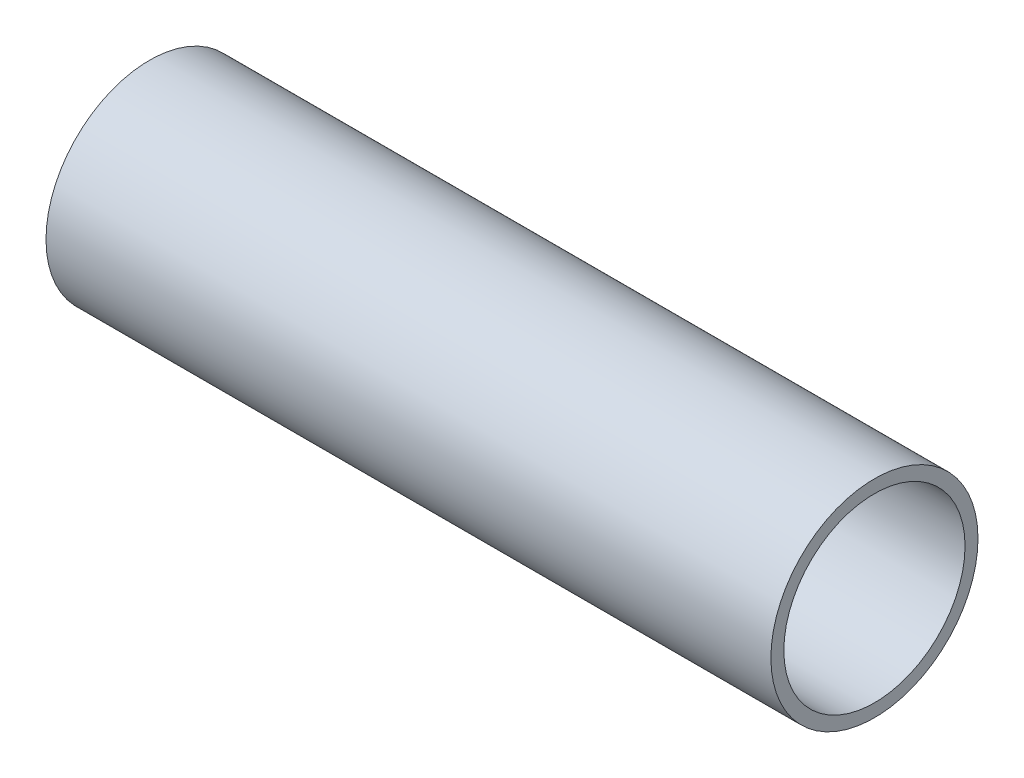
ISO-10303-21;
HEADER;
FILE_DESCRIPTION(('STEP AP214'),'2;1');
FILE_NAME('part.step','',(''),(''),'','','');
FILE_SCHEMA(('AUTOMOTIVE_DESIGN { 1 0 10303 214 1 1 1 1 }'));
ENDSEC;
DATA;
#1=APPLICATION_CONTEXT('core data for automotive mechanical design processes');
#2=APPLICATION_PROTOCOL_DEFINITION('international standard','automotive_design',2000,#1);
#3=PRODUCT_CONTEXT('',#1,'mechanical');
#4=PRODUCT('Part','Part','',(#3));
#5=PRODUCT_RELATED_PRODUCT_CATEGORY('part','',(#4));
#6=PRODUCT_DEFINITION_FORMATION('','',#4);
#7=PRODUCT_DEFINITION_CONTEXT('part definition',#1,'design');
#8=PRODUCT_DEFINITION('design','',#6,#7);
#9=PRODUCT_DEFINITION_SHAPE('','',#8);
#10=(LENGTH_UNIT() NAMED_UNIT(*) SI_UNIT(.MILLI.,.METRE.));
#11=(NAMED_UNIT(*) PLANE_ANGLE_UNIT() SI_UNIT($,.RADIAN.));
#12=(NAMED_UNIT(*) SI_UNIT($,.STERADIAN.) SOLID_ANGLE_UNIT());
#13=UNCERTAINTY_MEASURE_WITH_UNIT(LENGTH_MEASURE(1.E-05),#10,'distance_accuracy_value','');
#14=(GEOMETRIC_REPRESENTATION_CONTEXT(3) GLOBAL_UNCERTAINTY_ASSIGNED_CONTEXT((#13)) GLOBAL_UNIT_ASSIGNED_CONTEXT((#10,
#11,#12)) REPRESENTATION_CONTEXT('',''));
#15=CARTESIAN_POINT('',(0.,0.,0.));
#16=DIRECTION('',(0.,0.,1.));
#17=DIRECTION('',(1.,0.,0.));
#18=AXIS2_PLACEMENT_3D('',#15,#16,#17);
#19=CARTESIAN_POINT('',(177.8,0.,0.));
#20=DIRECTION('',(1.,0.,0.));
#21=DIRECTION('',(0.,0.,-1.));
#22=AXIS2_PLACEMENT_3D('',#19,#20,#21);
#23=PLANE('',#22);
#24=CARTESIAN_POINT('',(177.8,0.,0.));
#25=DIRECTION('',(1.,0.,0.));
#26=DIRECTION('',(0.,0.,-1.));
#27=AXIS2_PLACEMENT_3D('',#24,#25,#26);
#28=CIRCLE('',#27,25.4);
#29=CARTESIAN_POINT('',(177.8,0.,-25.4));
#30=VERTEX_POINT('',#29);
#31=EDGE_CURVE('E10',#30,#30,#28,.T.);
#32=ORIENTED_EDGE('',*,*,#31,.T.);
#33=EDGE_LOOP('',(#32));
#34=FACE_BOUND('',#33,.T.);
#35=CARTESIAN_POINT('',(177.8,0.,0.));
#36=DIRECTION('',(1.,0.,0.));
#37=DIRECTION('',(0.,0.,-1.));
#38=AXIS2_PLACEMENT_3D('',#35,#36,#37);
#39=CIRCLE('',#38,22.225);
#40=CARTESIAN_POINT('',(177.8,0.,-22.225));
#41=VERTEX_POINT('',#40);
#42=EDGE_CURVE('E50',#41,#41,#39,.T.);
#43=ORIENTED_EDGE('',*,*,#42,.F.);
#44=EDGE_LOOP('',(#43));
#45=FACE_BOUND('',#44,.T.);
#46=ADVANCED_FACE('F37',(#34,#45),#23,.T.);
#47=CARTESIAN_POINT('',(0.,0.,0.));
#48=DIRECTION('',(1.,0.,0.));
#49=DIRECTION('',(0.,0.,-1.));
#50=AXIS2_PLACEMENT_3D('',#47,#48,#49);
#51=PLANE('',#50);
#52=CARTESIAN_POINT('',(0.,0.,0.));
#53=DIRECTION('',(1.,0.,0.));
#54=DIRECTION('',(0.,0.,-1.));
#55=AXIS2_PLACEMENT_3D('',#52,#53,#54);
#56=CIRCLE('',#55,25.4);
#57=CARTESIAN_POINT('',(0.,0.,-25.4));
#58=VERTEX_POINT('',#57);
#59=EDGE_CURVE('E41',#58,#58,#56,.T.);
#60=ORIENTED_EDGE('',*,*,#59,.F.);
#61=EDGE_LOOP('',(#60));
#62=FACE_BOUND('',#61,.T.);
#63=CARTESIAN_POINT('',(0.,0.,0.));
#64=DIRECTION('',(1.,0.,0.));
#65=DIRECTION('',(0.,0.,-1.));
#66=AXIS2_PLACEMENT_3D('',#63,#64,#65);
#67=CIRCLE('',#66,22.225);
#68=CARTESIAN_POINT('',(0.,0.,-22.225));
#69=VERTEX_POINT('',#68);
#70=EDGE_CURVE('E52',#69,#69,#67,.T.);
#71=ORIENTED_EDGE('',*,*,#70,.T.);
#72=EDGE_LOOP('',(#71));
#73=FACE_BOUND('',#72,.T.);
#74=ADVANCED_FACE('F64',(#62,#73),#51,.F.);
#75=CARTESIAN_POINT('',(177.8,0.,0.));
#76=DIRECTION('',(-1.,0.,0.));
#77=DIRECTION('',(0.,0.,1.));
#78=AXIS2_PLACEMENT_3D('',#75,#76,#77);
#79=CYLINDRICAL_SURFACE('',#78,25.4);
#80=ORIENTED_EDGE('',*,*,#31,.F.);
#81=EDGE_LOOP('',(#80));
#82=FACE_BOUND('',#81,.T.);
#83=ORIENTED_EDGE('',*,*,#59,.T.);
#84=EDGE_LOOP('',(#83));
#85=FACE_BOUND('',#84,.T.);
#86=ADVANCED_FACE('F39',(#82,#85),#79,.T.);
#87=CARTESIAN_POINT('',(177.8,0.,0.));
#88=DIRECTION('',(-1.,0.,0.));
#89=DIRECTION('',(0.,0.,1.));
#90=AXIS2_PLACEMENT_3D('',#87,#88,#89);
#91=CYLINDRICAL_SURFACE('',#90,22.225);
#92=ORIENTED_EDGE('',*,*,#42,.T.);
#93=EDGE_LOOP('',(#92));
#94=FACE_BOUND('',#93,.T.);
#95=ORIENTED_EDGE('',*,*,#70,.F.);
#96=EDGE_LOOP('',(#95));
#97=FACE_BOUND('',#96,.T.);
#98=ADVANCED_FACE('F60',(#94,#97),#91,.F.);
#99=CLOSED_SHELL('',(#46,#74,#86,#98));
#100=MANIFOLD_SOLID_BREP('B2',#99);
#101=ADVANCED_BREP_SHAPE_REPRESENTATION('',(#18,#100),#14);
#102=SHAPE_DEFINITION_REPRESENTATION(#9,#101);
ENDSEC;
END-ISO-10303-21;
